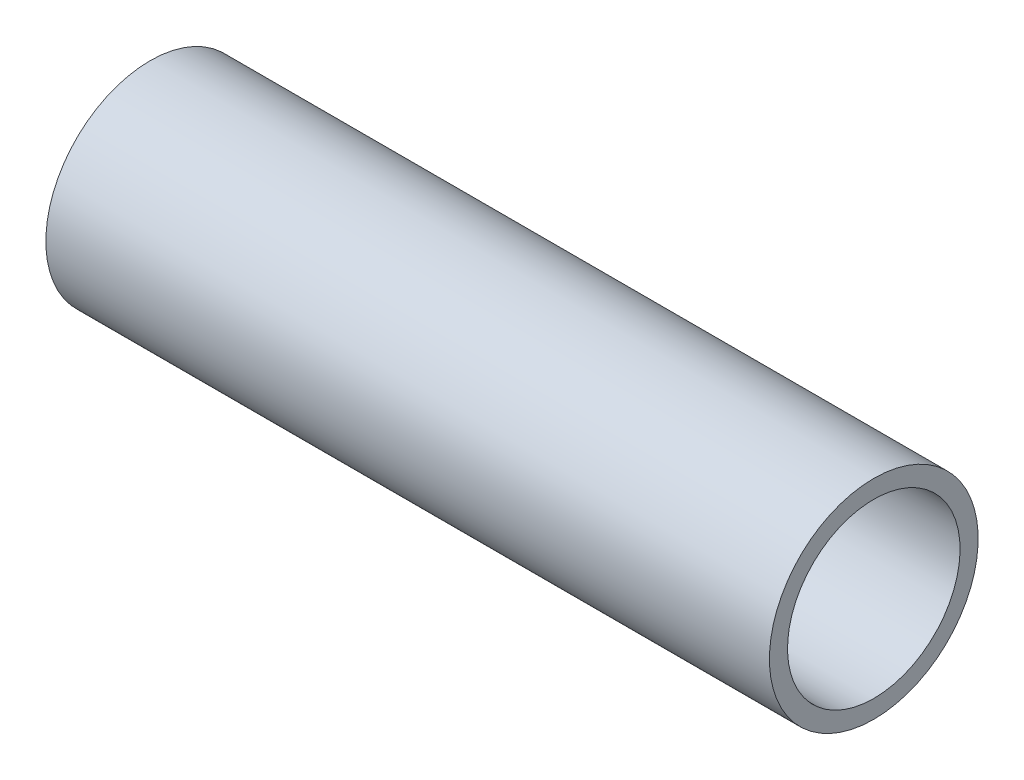
ISO-10303-21;
HEADER;
FILE_DESCRIPTION(('STEP AP214'),'2;1');
FILE_NAME('part.step','',(''),(''),'','','');
FILE_SCHEMA(('AUTOMOTIVE_DESIGN { 1 0 10303 214 1 1 1 1 }'));
ENDSEC;
DATA;
#1=APPLICATION_CONTEXT('core data for automotive mechanical design processes');
#2=APPLICATION_PROTOCOL_DEFINITION('international standard','automotive_design',2000,#1);
#3=PRODUCT_CONTEXT('',#1,'mechanical');
#4=PRODUCT('Part','Part','',(#3));
#5=PRODUCT_RELATED_PRODUCT_CATEGORY('part','',(#4));
#6=PRODUCT_DEFINITION_FORMATION('','',#4);
#7=PRODUCT_DEFINITION_CONTEXT('part definition',#1,'design');
#8=PRODUCT_DEFINITION('design','',#6,#7);
#9=PRODUCT_DEFINITION_SHAPE('','',#8);
#10=(LENGTH_UNIT() NAMED_UNIT(*) SI_UNIT(.MILLI.,.METRE.));
#11=(NAMED_UNIT(*) PLANE_ANGLE_UNIT() SI_UNIT($,.RADIAN.));
#12=(NAMED_UNIT(*) SI_UNIT($,.STERADIAN.) SOLID_ANGLE_UNIT());
#13=UNCERTAINTY_MEASURE_WITH_UNIT(LENGTH_MEASURE(1.E-05),#10,'distance_accuracy_value','');
#14=(GEOMETRIC_REPRESENTATION_CONTEXT(3) GLOBAL_UNCERTAINTY_ASSIGNED_CONTEXT((#13)) GLOBAL_UNIT_ASSIGNED_CONTEXT((#10,
#11,#12)) REPRESENTATION_CONTEXT('',''));
#15=CARTESIAN_POINT('',(0.,0.,0.));
#16=DIRECTION('',(0.,0.,1.));
#17=DIRECTION('',(1.,0.,0.));
#18=AXIS2_PLACEMENT_3D('',#15,#16,#17);
#19=CARTESIAN_POINT('',(66.04,0.,0.));
#20=DIRECTION('',(-1.,0.,0.));
#21=DIRECTION('',(0.,-1.,0.));
#22=AXIS2_PLACEMENT_3D('',#19,#20,#21);
#23=CYLINDRICAL_SURFACE('',#22,9.525);
#24=CARTESIAN_POINT('',(0.,0.,0.));
#25=DIRECTION('',(-1.,0.,0.));
#26=DIRECTION('',(0.,-1.,0.));
#27=AXIS2_PLACEMENT_3D('',#24,#25,#26);
#28=CIRCLE('',#27,9.525);
#29=CARTESIAN_POINT('',(0.,-9.525,0.));
#30=VERTEX_POINT('',#29);
#31=EDGE_CURVE('E45',#30,#30,#28,.T.);
#32=ORIENTED_EDGE('',*,*,#31,.F.);
#33=EDGE_LOOP('',(#32));
#34=FACE_BOUND('',#33,.T.);
#35=CARTESIAN_POINT('',(66.04,0.,0.));
#36=DIRECTION('',(-1.,0.,0.));
#37=DIRECTION('',(0.,-1.,0.));
#38=AXIS2_PLACEMENT_3D('',#35,#36,#37);
#39=CIRCLE('',#38,9.525);
#40=CARTESIAN_POINT('',(66.04,-9.52500000000001,0.));
#41=VERTEX_POINT('',#40);
#42=EDGE_CURVE('E36',#41,#41,#39,.T.);
#43=ORIENTED_EDGE('',*,*,#42,.T.);
#44=EDGE_LOOP('',(#43));
#45=FACE_BOUND('',#44,.T.);
#46=ADVANCED_FACE('F33',(#34,#45),#23,.T.);
#47=CARTESIAN_POINT('',(66.04,0.,0.));
#48=DIRECTION('',(-1.,0.,0.));
#49=DIRECTION('',(0.,-1.,0.));
#50=AXIS2_PLACEMENT_3D('',#47,#48,#49);
#51=PLANE('',#50);
#52=CARTESIAN_POINT('',(66.04,0.,0.));
#53=DIRECTION('',(-1.,0.,0.));
#54=DIRECTION('',(0.,-1.,0.));
#55=AXIS2_PLACEMENT_3D('',#52,#53,#54);
#56=CIRCLE('',#55,7.874);
#57=CARTESIAN_POINT('',(66.04,-7.87400000000001,0.));
#58=VERTEX_POINT('',#57);
#59=EDGE_CURVE('E40',#58,#58,#56,.F.);
#60=ORIENTED_EDGE('',*,*,#59,.F.);
#61=EDGE_LOOP('',(#60));
#62=FACE_BOUND('',#61,.T.);
#63=ORIENTED_EDGE('',*,*,#42,.F.);
#64=EDGE_LOOP('',(#63));
#65=FACE_BOUND('',#64,.T.);
#66=ADVANCED_FACE('F54',(#62,#65),#51,.F.);
#67=CARTESIAN_POINT('',(0.,0.,0.));
#68=DIRECTION('',(-1.,0.,0.));
#69=DIRECTION('',(0.,-1.,0.));
#70=AXIS2_PLACEMENT_3D('',#67,#68,#69);
#71=PLANE('',#70);
#72=CARTESIAN_POINT('',(0.,0.,0.));
#73=DIRECTION('',(-1.,0.,0.));
#74=DIRECTION('',(0.,-1.,0.));
#75=AXIS2_PLACEMENT_3D('',#72,#73,#74);
#76=CIRCLE('',#75,7.874);
#77=CARTESIAN_POINT('',(0.,-7.874,0.));
#78=VERTEX_POINT('',#77);
#79=EDGE_CURVE('E10',#78,#78,#76,.F.);
#80=ORIENTED_EDGE('',*,*,#79,.T.);
#81=EDGE_LOOP('',(#80));
#82=FACE_BOUND('',#81,.T.);
#83=ORIENTED_EDGE('',*,*,#31,.T.);
#84=EDGE_LOOP('',(#83));
#85=FACE_BOUND('',#84,.T.);
#86=ADVANCED_FACE('F56',(#82,#85),#71,.T.);
#87=CARTESIAN_POINT('',(66.04,0.,0.));
#88=DIRECTION('',(-1.,0.,0.));
#89=DIRECTION('',(0.,-1.,0.));
#90=AXIS2_PLACEMENT_3D('',#87,#88,#89);
#91=CYLINDRICAL_SURFACE('',#90,7.874);
#92=ORIENTED_EDGE('',*,*,#79,.F.);
#93=EDGE_LOOP('',(#92));
#94=FACE_BOUND('',#93,.T.);
#95=ORIENTED_EDGE('',*,*,#59,.T.);
#96=EDGE_LOOP('',(#95));
#97=FACE_BOUND('',#96,.T.);
#98=ADVANCED_FACE('F62',(#94,#97),#91,.F.);
#99=CLOSED_SHELL('',(#46,#66,#86,#98));
#100=MANIFOLD_SOLID_BREP('B2',#99);
#101=ADVANCED_BREP_SHAPE_REPRESENTATION('',(#18,#100),#14);
#102=SHAPE_DEFINITION_REPRESENTATION(#9,#101);
ENDSEC;
END-ISO-10303-21;
